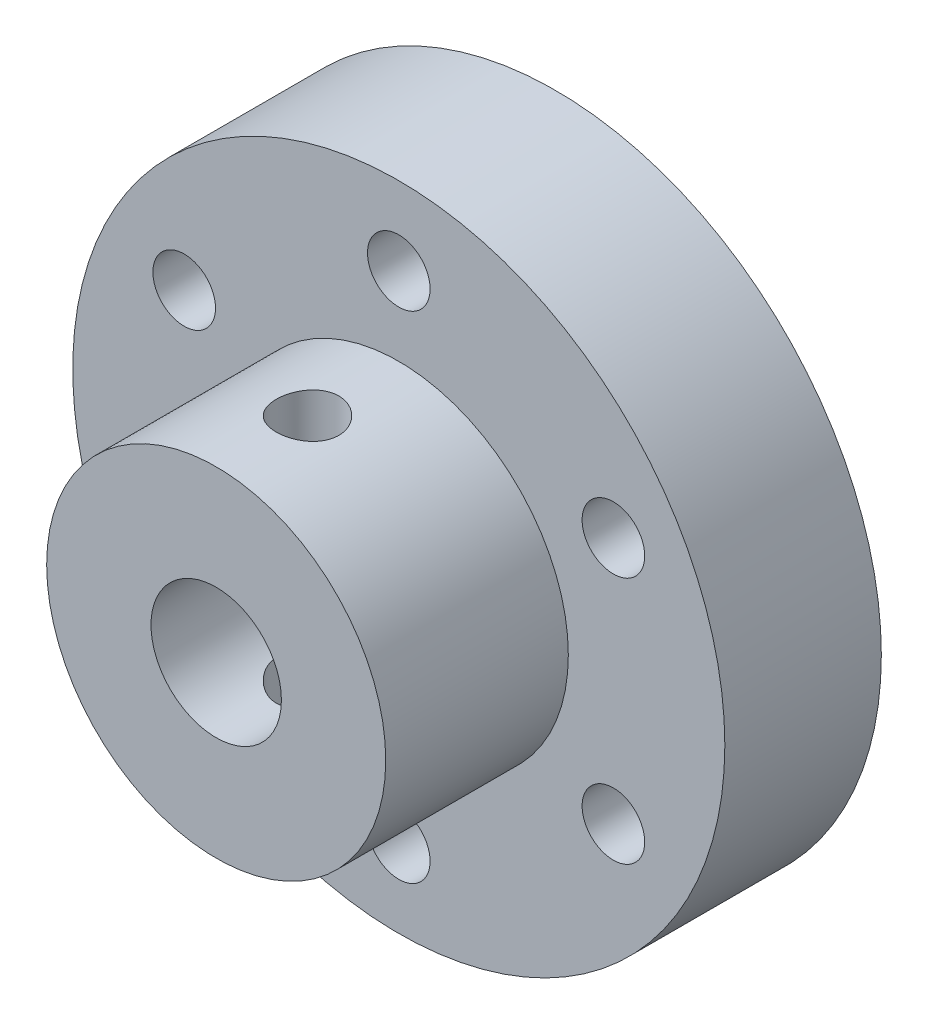
ISO-10303-21;
HEADER;
FILE_DESCRIPTION(('STEP AP214'),'2;1');
FILE_NAME('part.step','',(''),(''),'','','');
FILE_SCHEMA(('AUTOMOTIVE_DESIGN { 1 0 10303 214 1 1 1 1 }'));
ENDSEC;
DATA;
#1=APPLICATION_CONTEXT('core data for automotive mechanical design processes');
#2=APPLICATION_PROTOCOL_DEFINITION('international standard','automotive_design',2000,#1);
#3=PRODUCT_CONTEXT('',#1,'mechanical');
#4=PRODUCT('Part','Part','',(#3));
#5=PRODUCT_RELATED_PRODUCT_CATEGORY('part','',(#4));
#6=PRODUCT_DEFINITION_FORMATION('','',#4);
#7=PRODUCT_DEFINITION_CONTEXT('part definition',#1,'design');
#8=PRODUCT_DEFINITION('design','',#6,#7);
#9=PRODUCT_DEFINITION_SHAPE('','',#8);
#10=(LENGTH_UNIT() NAMED_UNIT(*) SI_UNIT(.MILLI.,.METRE.));
#11=(NAMED_UNIT(*) PLANE_ANGLE_UNIT() SI_UNIT($,.RADIAN.));
#12=(NAMED_UNIT(*) SI_UNIT($,.STERADIAN.) SOLID_ANGLE_UNIT());
#13=UNCERTAINTY_MEASURE_WITH_UNIT(LENGTH_MEASURE(1.E-05),#10,'distance_accuracy_value','');
#14=(GEOMETRIC_REPRESENTATION_CONTEXT(3) GLOBAL_UNCERTAINTY_ASSIGNED_CONTEXT((#13)) GLOBAL_UNIT_ASSIGNED_CONTEXT((#10,
#11,#12)) REPRESENTATION_CONTEXT('',''));
#15=CARTESIAN_POINT('',(0.,0.,0.));
#16=DIRECTION('',(0.,0.,1.));
#17=DIRECTION('',(1.,0.,0.));
#18=AXIS2_PLACEMENT_3D('',#15,#16,#17);
#19=CARTESIAN_POINT('',(0.,0.,13.));
#20=DIRECTION('',(0.,0.,-1.));
#21=DIRECTION('',(-1.,0.,0.));
#22=AXIS2_PLACEMENT_3D('',#19,#20,#21);
#23=CYLINDRICAL_SURFACE('',#22,6.5);
#24=CARTESIAN_POINT('',(0.,0.,13.));
#25=DIRECTION('',(0.,0.,1.));
#26=DIRECTION('',(1.,0.,0.));
#27=AXIS2_PLACEMENT_3D('',#24,#25,#26);
#28=CIRCLE('',#27,6.5);
#29=CARTESIAN_POINT('',(6.5,0.,13.));
#30=VERTEX_POINT('',#29);
#31=EDGE_CURVE('E130',#30,#30,#28,.T.);
#32=ORIENTED_EDGE('',*,*,#31,.F.);
#33=EDGE_LOOP('',(#32));
#34=FACE_BOUND('',#33,.T.);
#35=CARTESIAN_POINT('',(0.,0.,6.));
#36=DIRECTION('',(0.,0.,1.));
#37=DIRECTION('',(1.,0.,0.));
#38=AXIS2_PLACEMENT_3D('',#35,#36,#37);
#39=CIRCLE('',#38,6.5);
#40=CARTESIAN_POINT('',(6.5,0.,6.));
#41=VERTEX_POINT('',#40);
#42=EDGE_CURVE('E132',#41,#41,#39,.T.);
#43=ORIENTED_EDGE('',*,*,#42,.T.);
#44=EDGE_LOOP('',(#43));
#45=FACE_BOUND('',#44,.T.);
#46=CARTESIAN_POINT('',(0.,-6.5,8.3));
#47=CARTESIAN_POINT('',(0.0667962993626081,-6.49999879727572,8.30000257211707));
#48=CARTESIAN_POINT('',(0.133626281673587,-6.49895972178335,8.30559602783191));
#49=CARTESIAN_POINT('',(0.265404300030401,-6.49491478174011,8.32780839939203));
#50=CARTESIAN_POINT('',(0.330350677512255,-6.49190723570874,8.34443674147905));
#51=CARTESIAN_POINT('',(0.456436519782736,-6.48426191804226,8.38819343614064));
#52=CARTESIAN_POINT('',(0.517579319792998,-6.47962559903149,8.41531243477524));
#53=CARTESIAN_POINT('',(0.634441109694969,-6.46922952137734,8.47925437230046));
#54=CARTESIAN_POINT('',(0.690160564109867,-6.46346985907829,8.51607647909212));
#55=CARTESIAN_POINT('',(0.795247744205698,-6.45138834939994,8.59883396557512));
#56=CARTESIAN_POINT('',(0.844543292388614,-6.44506127279023,8.64486024386269));
#57=CARTESIAN_POINT('',(0.934759066401608,-6.43259702053078,8.74452399933484));
#58=CARTESIAN_POINT('',(0.975678701684754,-6.42645985829691,8.79816201273656));
#59=CARTESIAN_POINT('',(1.04827972317034,-6.41501951319584,8.91203468885105));
#60=CARTESIAN_POINT('',(1.07988798202191,-6.40972307507926,8.97231671204541));
#61=CARTESIAN_POINT('',(1.13250094978906,-6.40063738902812,9.09744933105612));
#62=CARTESIAN_POINT('',(1.15350654396689,-6.39684801526784,9.16229954493911));
#63=CARTESIAN_POINT('',(1.18408687284635,-6.39125806003697,9.29395639645086));
#64=CARTESIAN_POINT('',(1.19378730462821,-6.38943562620813,9.36073289196664));
#65=CARTESIAN_POINT('',(1.20187204389847,-6.38791998048299,9.49498860668542));
#66=CARTESIAN_POINT('',(1.20025733484479,-6.38822658354097,9.56246776430737));
#67=CARTESIAN_POINT('',(1.18585961873334,-6.39091446543458,9.69530461296547));
#68=CARTESIAN_POINT('',(1.17321929073711,-6.39326923845306,9.76067838386238));
#69=CARTESIAN_POINT('',(1.13735373323502,-6.39974652439446,9.88836113800026));
#70=CARTESIAN_POINT('',(1.11412806641468,-6.40386911035101,9.95066999450191));
#71=CARTESIAN_POINT('',(1.05761084900825,-6.41344535336497,10.0708730718194));
#72=CARTESIAN_POINT('',(1.0242614500129,-6.41890662438299,10.1287394617883));
#73=CARTESIAN_POINT('',(0.948484370023446,-6.43053982016241,10.2381087118248));
#74=CARTESIAN_POINT('',(0.906055794920213,-6.43671181488758,10.2896109443674));
#75=CARTESIAN_POINT('',(0.812554310960554,-6.44918666593044,10.3856145088169));
#76=CARTESIAN_POINT('',(0.761359307961523,-6.45549008145401,10.4299969416265));
#77=CARTESIAN_POINT('',(0.652187389345436,-6.46743086297198,10.5095611870548));
#78=CARTESIAN_POINT('',(0.594210409619175,-6.47306822266922,10.5447429126901));
#79=CARTESIAN_POINT('',(0.472998043002823,-6.48305257458405,10.6049236018053));
#80=CARTESIAN_POINT('',(0.409756516582691,-6.48739803241448,10.6299104698962));
#81=CARTESIAN_POINT('',(0.279875838888337,-6.49429705012122,10.6688733856488));
#82=CARTESIAN_POINT('',(0.213237038103507,-6.49685079444502,10.6828505667182));
#83=CARTESIAN_POINT('',(0.0794766430718829,-6.49985338930874,10.6992324791651));
#84=CARTESIAN_POINT('',(0.0123756497053713,-6.50033187707818,10.7018001653558));
#85=CARTESIAN_POINT('',(-0.121296981962713,-6.49921181273706,10.6957269238374));
#86=CARTESIAN_POINT('',(-0.187868645294989,-6.49761335943468,10.6870865293404));
#87=CARTESIAN_POINT('',(-0.318077984755796,-6.49253745576473,10.6589778880872));
#88=CARTESIAN_POINT('',(-0.381734009693139,-6.48907427500552,10.6395918384477));
#89=CARTESIAN_POINT('',(-0.504892375398316,-6.4806556240529,10.5906309426582));
#90=CARTESIAN_POINT('',(-0.564394440600633,-6.47570005497306,10.5610554213297));
#91=CARTESIAN_POINT('',(-0.678253095830679,-6.4647724074758,10.4921926389773));
#92=CARTESIAN_POINT('',(-0.732548265605505,-6.45879008348503,10.4528054836735));
#93=CARTESIAN_POINT('',(-0.833816870545852,-6.44649953986676,10.3655729863892));
#94=CARTESIAN_POINT('',(-0.880789643607566,-6.44019129083715,10.3177268803695));
#95=CARTESIAN_POINT('',(-0.966697085412809,-6.42786191143313,10.2141978916263));
#96=CARTESIAN_POINT('',(-1.00552070246097,-6.42184551244879,10.1584222026507));
#97=CARTESIAN_POINT('',(-1.07324774919417,-6.41087523291019,10.0410450642831));
#98=CARTESIAN_POINT('',(-1.10215154047974,-6.40592131362856,9.97944382735008));
#99=CARTESIAN_POINT('',(-1.14905975241548,-6.39767379439307,9.85245029126976));
#100=CARTESIAN_POINT('',(-1.16711570494917,-6.39437235713613,9.7870775593624));
#101=CARTESIAN_POINT('',(-1.19197513111159,-6.38978543443045,9.65415982283927));
#102=CARTESIAN_POINT('',(-1.19877983115992,-6.38849972926177,9.58661505580006));
#103=CARTESIAN_POINT('',(-1.20090353537778,-6.3881007482456,9.45238244271729));
#104=CARTESIAN_POINT('',(-1.19639765292492,-6.38895435075601,9.38569740246967));
#105=CARTESIAN_POINT('',(-1.17641079397786,-6.39266448585662,9.25405258113934));
#106=CARTESIAN_POINT('',(-1.16092987834811,-6.39552100733921,9.18909279049095));
#107=CARTESIAN_POINT('',(-1.11950532017773,-6.40290136886896,9.06283280373736));
#108=CARTESIAN_POINT('',(-1.09358007946632,-6.40742227523992,9.00152638771167));
#109=CARTESIAN_POINT('',(-1.032021760182,-6.41762418955728,8.88410526232611));
#110=CARTESIAN_POINT('',(-0.996388024820644,-6.42330527598439,8.82799090455786));
#111=CARTESIAN_POINT('',(-0.915813071798076,-6.43529057182139,8.72166848381106));
#112=CARTESIAN_POINT('',(-0.870744203302653,-6.44160263227606,8.67155802803138));
#113=CARTESIAN_POINT('',(-0.772845002820406,-6.45407937835197,8.57955246098663));
#114=CARTESIAN_POINT('',(-0.720012889705215,-6.46024402977463,8.53765924017314));
#115=CARTESIAN_POINT('',(-0.607537484977905,-6.47179409996219,8.46293825948846));
#116=CARTESIAN_POINT('',(-0.547839004017674,-6.47717228318667,8.43019242527087));
#117=CARTESIAN_POINT('',(-0.42370854944922,-6.48647285935735,8.37524717130095));
#118=CARTESIAN_POINT('',(-0.3592811283988,-6.49039663100581,8.35303775798059));
#119=CARTESIAN_POINT('',(-0.245545866371185,-6.49553807584249,8.32435080717887));
#120=CARTESIAN_POINT('',(-0.196906528350574,-6.49720192234607,8.31523471554344));
#121=CARTESIAN_POINT('',(-0.0988509306569767,-6.49943331626516,8.30305843317357));
#122=CARTESIAN_POINT('',(-0.0494346897454305,-6.50000089011371,8.29999809642434));
#123=CARTESIAN_POINT('',(0.,-6.5,8.3));
#124=B_SPLINE_CURVE_WITH_KNOTS('',3,(#46,#47,#48,#49,#50,#51,#52,#53,#54,#55,#56,#57,#58,#59,
#60,#61,#62,#63,#64,#65,#66,#67,#68,#69,#70,#71,#72,#73,#74,#75,#76,#77,#78,#79,#80,#81,#82,#83,
#84,#85,#86,#87,#88,#89,#90,#91,#92,#93,#94,#95,#96,#97,#98,#99,#100,#101,#102,#103,#104,#105,
#106,#107,#108,#109,#110,#111,#112,#113,#114,#115,#116,#117,#118,#119,#120,#121,#122,#123),
.UNSPECIFIED.,.T.,.F.,(4,2,2,2,2,2,2,2,2,2,2,2,2,2,2,2,2,2,2,2,2,2,2,2,2,2,2,2,2,2,2,2,2,2,2,2,
2,2,4),(0.,0.200208125257265,0.400587493204053,0.600788604213541,0.800972552376601,
1.00324088953467,1.20552348279051,1.40935476877731,1.61316903319364,1.81469487992138,
2.01620321120369,2.21514193787252,2.41408888408644,2.61419475105378,2.81432033334393,
3.01750151628567,3.2206846200298,3.42410808829514,3.6275106121083,3.8279985269071,
4.02847690406412,4.22744250539259,4.42642129319003,4.62751523490318,4.8286273493452,
5.03232388047527,5.23601298560803,5.43872666786995,5.64141825228765,5.84099112816951,
6.04056289728494,6.23978456857919,6.43901972074741,6.64114822168658,6.84332316977221,
7.04725467103853,7.25099235904023,7.39916621446434,7.54733649711547),.UNSPECIFIED.);
#125=CARTESIAN_POINT('',(0.,-6.5,8.3));
#126=VERTEX_POINT('',#125);
#127=EDGE_CURVE('E76',#126,#126,#124,.T.);
#128=ORIENTED_EDGE('',*,*,#127,.F.);
#129=EDGE_LOOP('',(#128));
#130=FACE_BOUND('',#129,.T.);
#131=CARTESIAN_POINT('',(0.,6.5,8.3));
#132=CARTESIAN_POINT('',(-0.0667962993626081,6.49999879727572,8.30000257211707));
#133=CARTESIAN_POINT('',(-0.133626281673587,6.49895972178335,8.30559602783191));
#134=CARTESIAN_POINT('',(-0.265404300030401,6.49491478174011,8.32780839939203));
#135=CARTESIAN_POINT('',(-0.330350677512255,6.49190723570874,8.34443674147905));
#136=CARTESIAN_POINT('',(-0.456436519782736,6.48426191804226,8.38819343614064));
#137=CARTESIAN_POINT('',(-0.517579319792998,6.47962559903149,8.41531243477524));
#138=CARTESIAN_POINT('',(-0.634441109694969,6.46922952137734,8.47925437230046));
#139=CARTESIAN_POINT('',(-0.690160564109867,6.46346985907829,8.51607647909212));
#140=CARTESIAN_POINT('',(-0.795247744205698,6.45138834939994,8.59883396557512));
#141=CARTESIAN_POINT('',(-0.844543292388614,6.44506127279023,8.64486024386269));
#142=CARTESIAN_POINT('',(-0.934759066401608,6.43259702053078,8.74452399933484));
#143=CARTESIAN_POINT('',(-0.975678701684754,6.42645985829691,8.79816201273656));
#144=CARTESIAN_POINT('',(-1.04827972317034,6.41501951319584,8.91203468885105));
#145=CARTESIAN_POINT('',(-1.07988798202191,6.40972307507926,8.97231671204541));
#146=CARTESIAN_POINT('',(-1.13250094978906,6.40063738902812,9.09744933105612));
#147=CARTESIAN_POINT('',(-1.15350654396689,6.39684801526784,9.16229954493911));
#148=CARTESIAN_POINT('',(-1.18408687284635,6.39125806003697,9.29395639645086));
#149=CARTESIAN_POINT('',(-1.19378730462821,6.38943562620813,9.36073289196664));
#150=CARTESIAN_POINT('',(-1.20187204389847,6.38791998048299,9.49498860668542));
#151=CARTESIAN_POINT('',(-1.20025733484479,6.38822658354097,9.56246776430737));
#152=CARTESIAN_POINT('',(-1.18585961873334,6.39091446543458,9.69530461296547));
#153=CARTESIAN_POINT('',(-1.17321929073711,6.39326923845306,9.76067838386238));
#154=CARTESIAN_POINT('',(-1.13735373323502,6.39974652439446,9.88836113800026));
#155=CARTESIAN_POINT('',(-1.11412806641468,6.40386911035101,9.95066999450191));
#156=CARTESIAN_POINT('',(-1.05761084900825,6.41344535336497,10.0708730718194));
#157=CARTESIAN_POINT('',(-1.0242614500129,6.41890662438299,10.1287394617883));
#158=CARTESIAN_POINT('',(-0.948484370023446,6.43053982016241,10.2381087118248));
#159=CARTESIAN_POINT('',(-0.906055794920213,6.43671181488758,10.2896109443674));
#160=CARTESIAN_POINT('',(-0.812554310960554,6.44918666593044,10.3856145088169));
#161=CARTESIAN_POINT('',(-0.761359307961523,6.45549008145401,10.4299969416265));
#162=CARTESIAN_POINT('',(-0.652187389345436,6.46743086297198,10.5095611870548));
#163=CARTESIAN_POINT('',(-0.594210409619175,6.47306822266922,10.5447429126901));
#164=CARTESIAN_POINT('',(-0.472998043002823,6.48305257458405,10.6049236018053));
#165=CARTESIAN_POINT('',(-0.409756516582691,6.48739803241448,10.6299104698962));
#166=CARTESIAN_POINT('',(-0.279875838888337,6.49429705012122,10.6688733856488));
#167=CARTESIAN_POINT('',(-0.213237038103507,6.49685079444502,10.6828505667182));
#168=CARTESIAN_POINT('',(-0.0794766430718829,6.49985338930874,10.6992324791651));
#169=CARTESIAN_POINT('',(-0.0123756497053713,6.50033187707818,10.7018001653558));
#170=CARTESIAN_POINT('',(0.121296981962713,6.49921181273706,10.6957269238374));
#171=CARTESIAN_POINT('',(0.187868645294989,6.49761335943468,10.6870865293404));
#172=CARTESIAN_POINT('',(0.318077984755796,6.49253745576473,10.6589778880872));
#173=CARTESIAN_POINT('',(0.381734009693139,6.48907427500552,10.6395918384477));
#174=CARTESIAN_POINT('',(0.504892375398316,6.4806556240529,10.5906309426582));
#175=CARTESIAN_POINT('',(0.564394440600633,6.47570005497306,10.5610554213297));
#176=CARTESIAN_POINT('',(0.678253095830679,6.4647724074758,10.4921926389773));
#177=CARTESIAN_POINT('',(0.732548265605505,6.45879008348503,10.4528054836735));
#178=CARTESIAN_POINT('',(0.833816870545852,6.44649953986676,10.3655729863892));
#179=CARTESIAN_POINT('',(0.880789643607566,6.44019129083715,10.3177268803695));
#180=CARTESIAN_POINT('',(0.966697085412809,6.42786191143313,10.2141978916263));
#181=CARTESIAN_POINT('',(1.00552070246097,6.42184551244879,10.1584222026507));
#182=CARTESIAN_POINT('',(1.07324774919417,6.41087523291019,10.0410450642831));
#183=CARTESIAN_POINT('',(1.10215154047974,6.40592131362856,9.97944382735008));
#184=CARTESIAN_POINT('',(1.14905975241548,6.39767379439307,9.85245029126976));
#185=CARTESIAN_POINT('',(1.16711570494917,6.39437235713613,9.7870775593624));
#186=CARTESIAN_POINT('',(1.19197513111159,6.38978543443045,9.65415982283927));
#187=CARTESIAN_POINT('',(1.19877983115992,6.38849972926177,9.58661505580006));
#188=CARTESIAN_POINT('',(1.20090353537778,6.3881007482456,9.45238244271729));
#189=CARTESIAN_POINT('',(1.19639765292492,6.38895435075601,9.38569740246967));
#190=CARTESIAN_POINT('',(1.17641079397786,6.39266448585662,9.25405258113934));
#191=CARTESIAN_POINT('',(1.16092987834811,6.39552100733921,9.18909279049095));
#192=CARTESIAN_POINT('',(1.11950532017773,6.40290136886896,9.06283280373736));
#193=CARTESIAN_POINT('',(1.09358007946632,6.40742227523992,9.00152638771167));
#194=CARTESIAN_POINT('',(1.032021760182,6.41762418955728,8.88410526232611));
#195=CARTESIAN_POINT('',(0.996388024820644,6.42330527598439,8.82799090455786));
#196=CARTESIAN_POINT('',(0.915813071798076,6.43529057182139,8.72166848381106));
#197=CARTESIAN_POINT('',(0.870744203302653,6.44160263227606,8.67155802803138));
#198=CARTESIAN_POINT('',(0.772845002820406,6.45407937835197,8.57955246098663));
#199=CARTESIAN_POINT('',(0.720012889705215,6.46024402977463,8.53765924017314));
#200=CARTESIAN_POINT('',(0.607537484977905,6.47179409996219,8.46293825948846));
#201=CARTESIAN_POINT('',(0.547839004017674,6.47717228318667,8.43019242527087));
#202=CARTESIAN_POINT('',(0.42370854944922,6.48647285935735,8.37524717130095));
#203=CARTESIAN_POINT('',(0.3592811283988,6.49039663100581,8.35303775798059));
#204=CARTESIAN_POINT('',(0.245545866371185,6.49553807584249,8.32435080717887));
#205=CARTESIAN_POINT('',(0.196906528350574,6.49720192234607,8.31523471554344));
#206=CARTESIAN_POINT('',(0.0988509306569767,6.49943331626516,8.30305843317357));
#207=CARTESIAN_POINT('',(0.0494346897454305,6.50000089011371,8.29999809642434));
#208=CARTESIAN_POINT('',(0.,6.5,8.3));
#209=B_SPLINE_CURVE_WITH_KNOTS('',3,(#131,#132,#133,#134,#135,#136,#137,#138,#139,#140,#141,
#142,#143,#144,#145,#146,#147,#148,#149,#150,#151,#152,#153,#154,#155,#156,#157,#158,#159,#160,
#161,#162,#163,#164,#165,#166,#167,#168,#169,#170,#171,#172,#173,#174,#175,#176,#177,#178,#179,
#180,#181,#182,#183,#184,#185,#186,#187,#188,#189,#190,#191,#192,#193,#194,#195,#196,#197,#198,
#199,#200,#201,#202,#203,#204,#205,#206,#207,#208),.UNSPECIFIED.,.T.,.F.,(4,2,2,2,2,2,2,2,2,2,2,
2,2,2,2,2,2,2,2,2,2,2,2,2,2,2,2,2,2,2,2,2,2,2,2,2,2,2,4),(0.,0.200208125257265,
0.400587493204053,0.600788604213541,0.800972552376601,1.00324088953467,1.20552348279051,
1.40935476877731,1.61316903319364,1.81469487992138,2.01620321120369,2.21514193787252,
2.41408888408644,2.61419475105378,2.81432033334393,3.01750151628567,3.2206846200298,
3.42410808829514,3.6275106121083,3.8279985269071,4.02847690406412,4.22744250539259,
4.42642129319003,4.62751523490318,4.8286273493452,5.03232388047527,5.23601298560803,
5.43872666786995,5.64141825228765,5.84099112816951,6.04056289728494,6.23978456857919,
6.43901972074741,6.64114822168658,6.84332316977221,7.04725467103853,7.25099235904023,
7.39916621446434,7.54733649711547),.UNSPECIFIED.);
#210=CARTESIAN_POINT('',(0.,6.5,8.3));
#211=VERTEX_POINT('',#210);
#212=EDGE_CURVE('E82',#211,#211,#209,.T.);
#213=ORIENTED_EDGE('',*,*,#212,.F.);
#214=EDGE_LOOP('',(#213));
#215=FACE_BOUND('',#214,.T.);
#216=ADVANCED_FACE('F31',(#34,#45,#130,#215),#23,.T.);
#217=CARTESIAN_POINT('',(0.,0.,13.));
#218=DIRECTION('',(0.,0.,-1.));
#219=DIRECTION('',(-1.,0.,0.));
#220=AXIS2_PLACEMENT_3D('',#217,#218,#219);
#221=CYLINDRICAL_SURFACE('',#220,2.5);
#222=CARTESIAN_POINT('',(0.,-2.5,8.3));
#223=CARTESIAN_POINT('',(0.0633849742179673,-2.49999684385891,8.30000370648809));
#224=CARTESIAN_POINT('',(0.126854370812595,-2.49756312112456,8.30505164362475));
#225=CARTESIAN_POINT('',(0.251936101998812,-2.48806801727453,8.325028983493));
#226=CARTESIAN_POINT('',(0.313544265904984,-2.48099694847778,8.33997907303935));
#227=CARTESIAN_POINT('',(0.432899849747275,-2.46297121786789,8.37905156229005));
#228=CARTESIAN_POINT('',(0.490660900321686,-2.45203124122226,8.40313930310366));
#229=CARTESIAN_POINT('',(0.60124535759609,-2.42728640809076,8.45963335220408));
#230=CARTESIAN_POINT('',(0.654069413581729,-2.4134819290992,8.4920385645181));
#231=CARTESIAN_POINT('',(0.756672008759831,-2.38337302664708,8.56635874632256));
#232=CARTESIAN_POINT('',(0.806104935594568,-2.36697091704208,8.60871073907671));
#233=CARTESIAN_POINT('',(0.897480036845475,-2.3338586106312,8.70078689566182));
#234=CARTESIAN_POINT('',(0.939416979471579,-2.31714820755791,8.75051616447448));
#235=CARTESIAN_POINT('',(1.01754320621259,-2.28397287809421,8.86012166281187));
#236=CARTESIAN_POINT('',(1.05312476430902,-2.26760699355557,8.92046447845293));
#237=CARTESIAN_POINT('',(1.11348408792889,-2.23858941478561,9.04715667046847));
#238=CARTESIAN_POINT('',(1.13826909234645,-2.22593523378932,9.1135019861197));
#239=CARTESIAN_POINT('',(1.17479858114972,-2.20686509491432,9.24639257733738));
#240=CARTESIAN_POINT('',(1.18721180020386,-2.20013187804712,9.31270634717295));
#241=CARTESIAN_POINT('',(1.20070733624948,-2.19279905539547,9.44678957240425));
#242=CARTESIAN_POINT('',(1.20179935761816,-2.19219419647575,9.51455773116942));
#243=CARTESIAN_POINT('',(1.19311469398861,-2.19692748260396,9.64176853081165));
#244=CARTESIAN_POINT('',(1.18449959005718,-2.20163056600635,9.70131958394927));
#245=CARTESIAN_POINT('',(1.15864142470197,-2.21534692921024,9.81799745385986));
#246=CARTESIAN_POINT('',(1.14139595212355,-2.22436141350086,9.87512358831726));
#247=CARTESIAN_POINT('',(1.09843555987642,-2.24589080547588,9.98694185262371));
#248=CARTESIAN_POINT('',(1.07253294877242,-2.25848226491406,10.0415464458527));
#249=CARTESIAN_POINT('',(1.01313344094007,-2.28574437002242,10.1458859580842));
#250=CARTESIAN_POINT('',(0.979633174271466,-2.30041593723866,10.1956187021187));
#251=CARTESIAN_POINT('',(0.901464111982097,-2.33223919109194,10.2948578772651));
#252=CARTESIAN_POINT('',(0.85595175893152,-2.34948147766575,10.3436730304729));
#253=CARTESIAN_POINT('',(0.75728622082949,-2.38311434513901,10.433252185107));
#254=CARTESIAN_POINT('',(0.704129930767406,-2.39950457622712,10.4740128987222));
#255=CARTESIAN_POINT('',(0.588992124092923,-2.43038572230261,10.5478283711417));
#256=CARTESIAN_POINT('',(0.526744081421431,-2.44477544111425,10.5805130948424));
#257=CARTESIAN_POINT('',(0.396765720474065,-2.46919745924495,10.6346911077138));
#258=CARTESIAN_POINT('',(0.329039471001532,-2.47923295793025,10.6561926163331));
#259=CARTESIAN_POINT('',(0.195718131600795,-2.49315669713845,10.6857425282756));
#260=CARTESIAN_POINT('',(0.130371482184072,-2.49746478900867,10.6947125912192));
#261=CARTESIAN_POINT('',(-0.00103238515457059,-2.50086207141464,10.7017997500693));
#262=CARTESIAN_POINT('',(-0.0670892927363438,-2.4999534556786,10.6999214079415));
#263=CARTESIAN_POINT('',(-0.193123316285083,-2.4932728768651,10.6859348130393));
#264=CARTESIAN_POINT('',(-0.253201883269907,-2.4878465157843,10.6745533621869));
#265=CARTESIAN_POINT('',(-0.370489514239621,-2.47310188561777,10.6429903895089));
#266=CARTESIAN_POINT('',(-0.427698249411483,-2.46378317169856,10.6228078618498));
#267=CARTESIAN_POINT('',(-0.539593801410593,-2.44175951914454,10.5736323177078));
#268=CARTESIAN_POINT('',(-0.594153429738361,-2.42896136015527,10.5443930958483));
#269=CARTESIAN_POINT('',(-0.697781190567038,-2.40124618620779,10.4782054654661));
#270=CARTESIAN_POINT('',(-0.746846909587697,-2.38632824650655,10.4412536890665));
#271=CARTESIAN_POINT('',(-0.842873798160822,-2.35422107284488,10.356750671008));
#272=CARTESIAN_POINT('',(-0.889225495967946,-2.33694916915075,10.3085368470266));
#273=CARTESIAN_POINT('',(-0.97343008777859,-2.30314934154574,10.2049076280905));
#274=CARTESIAN_POINT('',(-1.01127822755546,-2.28662183792686,10.1494882317929));
#275=CARTESIAN_POINT('',(-1.07873607730324,-2.2556069584878,10.0302772602201));
#276=CARTESIAN_POINT('',(-1.10797295572395,-2.24122249229772,9.9662456666059));
#277=CARTESIAN_POINT('',(-1.15494631784804,-2.21738674528501,9.83325192023934));
#278=CARTESIAN_POINT('',(-1.17269639468182,-2.20792963617194,9.76429570287884));
#279=CARTESIAN_POINT('',(-1.19465474613,-2.19611962570153,9.63028263211508));
#280=CARTESIAN_POINT('',(-1.19996744321152,-2.19318858167521,9.56545828249615));
#281=CARTESIAN_POINT('',(-1.2000322208,-2.19315404190355,9.43581269383091));
#282=CARTESIAN_POINT('',(-1.19478781986411,-2.19604860455165,9.37099146094644));
#283=CARTESIAN_POINT('',(-1.1748980429029,-2.20674497123885,9.2487253246722));
#284=CARTESIAN_POINT('',(-1.16105236546225,-2.21412829866181,9.19110940118316));
#285=CARTESIAN_POINT('',(-1.1252866074732,-2.23251696488275,9.07905904144424));
#286=CARTESIAN_POINT('',(-1.10336406140807,-2.24352340955145,9.02462558254745));
#287=CARTESIAN_POINT('',(-1.05040716590157,-2.26882328290811,8.91646699976793));
#288=CARTESIAN_POINT('',(-1.01886080058498,-2.28328751262241,8.86303360235449));
#289=CARTESIAN_POINT('',(-0.948152153973279,-2.31354400874608,8.76188093120729));
#290=CARTESIAN_POINT('',(-0.908986128039517,-2.32933692595659,8.71416448574386));
#291=CARTESIAN_POINT('',(-0.819149694061577,-2.36252519611289,8.62042538069649));
#292=CARTESIAN_POINT('',(-0.767691958629031,-2.3799083892852,8.57514892576238));
#293=CARTESIAN_POINT('',(-0.657371196902567,-2.41271041519055,8.49373870031008));
#294=CARTESIAN_POINT('',(-0.598504520879331,-2.42812827218994,8.45760946241547));
#295=CARTESIAN_POINT('',(-0.474804107606464,-2.45531401707798,8.39576327805479));
#296=CARTESIAN_POINT('',(-0.409975812829995,-2.46708519202428,8.37003694815901));
#297=CARTESIAN_POINT('',(-0.276277415550764,-2.48559657511608,8.33016813803939));
#298=CARTESIAN_POINT('',(-0.207419779549854,-2.49235149862408,8.31599176360715));
#299=CARTESIAN_POINT('',(-0.114956061483877,-2.49746191467227,8.30529572720423));
#300=CARTESIAN_POINT('',(-0.0920238242785925,-2.49841158308983,8.30331222135545));
#301=CARTESIAN_POINT('',(-0.0460647770818748,-2.49968120698223,8.30066366813027));
#302=CARTESIAN_POINT('',(-0.0230379648028422,-2.50000114713413,8.29999865283621));
#303=CARTESIAN_POINT('',(0.,-2.5,8.3));
#304=B_SPLINE_CURVE_WITH_KNOTS('',3,(#222,#223,#224,#225,#226,#227,#228,#229,#230,#231,#232,
#233,#234,#235,#236,#237,#238,#239,#240,#241,#242,#243,#244,#245,#246,#247,#248,#249,#250,#251,
#252,#253,#254,#255,#256,#257,#258,#259,#260,#261,#262,#263,#264,#265,#266,#267,#268,#269,#270,
#271,#272,#273,#274,#275,#276,#277,#278,#279,#280,#281,#282,#283,#284,#285,#286,#287,#288,#289,
#290,#291,#292,#293,#294,#295,#296,#297,#298,#299,#300,#301,#302,#303),.UNSPECIFIED.,.T.,.F.,(4,
2,2,2,2,2,2,2,2,2,2,2,2,2,2,2,2,2,2,2,2,2,2,2,2,2,2,2,2,2,2,2,2,2,2,2,2,2,2,2,4),(0.,
0.190061051260785,0.380520421131581,0.57026449156264,0.759983572707097,0.960524852603022,
1.16120555749543,1.37593216553996,1.59051458084295,1.7927406006974,1.99479326080114,
2.1750147680024,2.35528665366777,2.53975218942436,2.72429970544775,2.9301890909405,
3.13616234736342,3.35031022232777,3.56430047950079,3.76153307471438,3.95868273581696,
4.14200365721815,4.3253455349944,4.51418899570865,4.70311509274789,4.90943190815755,
5.11586378710751,5.33023499254597,5.54435205150114,5.73858642474551,5.93275607266577,
6.11112580194469,6.28955002491833,6.47992680285666,6.67039737779789,6.88154505737434,
7.09279716084658,7.30385828744261,7.51429778555126,7.58337588054014,7.65245565636019),.UNSPECIFIED.);
#305=CARTESIAN_POINT('',(0.,-2.5,8.3));
#306=VERTEX_POINT('',#305);
#307=EDGE_CURVE('E48',#306,#306,#304,.T.);
#308=ORIENTED_EDGE('',*,*,#307,.T.);
#309=EDGE_LOOP('',(#308));
#310=FACE_BOUND('',#309,.T.);
#311=CARTESIAN_POINT('',(0.,0.,13.));
#312=DIRECTION('',(0.,0.,1.));
#313=DIRECTION('',(1.,0.,0.));
#314=AXIS2_PLACEMENT_3D('',#311,#312,#313);
#315=CIRCLE('',#314,2.5);
#316=CARTESIAN_POINT('',(2.5,0.,13.));
#317=VERTEX_POINT('',#316);
#318=EDGE_CURVE('E136',#317,#317,#315,.T.);
#319=ORIENTED_EDGE('',*,*,#318,.T.);
#320=EDGE_LOOP('',(#319));
#321=FACE_BOUND('',#320,.T.);
#322=CARTESIAN_POINT('',(0.,0.,6.));
#323=DIRECTION('',(0.,0.,1.));
#324=DIRECTION('',(1.,0.,0.));
#325=AXIS2_PLACEMENT_3D('',#322,#323,#324);
#326=CIRCLE('',#325,2.5);
#327=CARTESIAN_POINT('',(2.5,0.,6.));
#328=VERTEX_POINT('',#327);
#329=EDGE_CURVE('E10',#328,#328,#326,.F.);
#330=ORIENTED_EDGE('',*,*,#329,.T.);
#331=EDGE_LOOP('',(#330));
#332=FACE_BOUND('',#331,.T.);
#333=CARTESIAN_POINT('',(0.,2.5,8.3));
#334=CARTESIAN_POINT('',(-0.0633849742179673,2.49999684385891,8.30000370648809));
#335=CARTESIAN_POINT('',(-0.126854370812595,2.49756312112456,8.30505164362475));
#336=CARTESIAN_POINT('',(-0.251936101998812,2.48806801727453,8.325028983493));
#337=CARTESIAN_POINT('',(-0.313544265904984,2.48099694847778,8.33997907303935));
#338=CARTESIAN_POINT('',(-0.432899849747275,2.46297121786789,8.37905156229005));
#339=CARTESIAN_POINT('',(-0.490660900321686,2.45203124122226,8.40313930310366));
#340=CARTESIAN_POINT('',(-0.60124535759609,2.42728640809076,8.45963335220408));
#341=CARTESIAN_POINT('',(-0.654069413581729,2.4134819290992,8.4920385645181));
#342=CARTESIAN_POINT('',(-0.756672008759831,2.38337302664708,8.56635874632256));
#343=CARTESIAN_POINT('',(-0.806104935594568,2.36697091704208,8.60871073907671));
#344=CARTESIAN_POINT('',(-0.897480036845475,2.3338586106312,8.70078689566182));
#345=CARTESIAN_POINT('',(-0.939416979471579,2.31714820755791,8.75051616447448));
#346=CARTESIAN_POINT('',(-1.01754320621259,2.28397287809421,8.86012166281187));
#347=CARTESIAN_POINT('',(-1.05312476430902,2.26760699355557,8.92046447845293));
#348=CARTESIAN_POINT('',(-1.11348408792889,2.23858941478561,9.04715667046847));
#349=CARTESIAN_POINT('',(-1.13826909234645,2.22593523378932,9.1135019861197));
#350=CARTESIAN_POINT('',(-1.17479858114972,2.20686509491432,9.24639257733738));
#351=CARTESIAN_POINT('',(-1.18721180020386,2.20013187804712,9.31270634717295));
#352=CARTESIAN_POINT('',(-1.20070733624948,2.19279905539547,9.44678957240425));
#353=CARTESIAN_POINT('',(-1.20179935761816,2.19219419647575,9.51455773116942));
#354=CARTESIAN_POINT('',(-1.19311469398861,2.19692748260396,9.64176853081165));
#355=CARTESIAN_POINT('',(-1.18449959005718,2.20163056600635,9.70131958394927));
#356=CARTESIAN_POINT('',(-1.15864142470197,2.21534692921024,9.81799745385986));
#357=CARTESIAN_POINT('',(-1.14139595212355,2.22436141350086,9.87512358831726));
#358=CARTESIAN_POINT('',(-1.09843555987642,2.24589080547588,9.98694185262371));
#359=CARTESIAN_POINT('',(-1.07253294877242,2.25848226491406,10.0415464458527));
#360=CARTESIAN_POINT('',(-1.01313344094007,2.28574437002242,10.1458859580842));
#361=CARTESIAN_POINT('',(-0.979633174271466,2.30041593723866,10.1956187021187));
#362=CARTESIAN_POINT('',(-0.901464111982097,2.33223919109194,10.2948578772651));
#363=CARTESIAN_POINT('',(-0.85595175893152,2.34948147766575,10.3436730304729));
#364=CARTESIAN_POINT('',(-0.75728622082949,2.38311434513901,10.433252185107));
#365=CARTESIAN_POINT('',(-0.704129930767406,2.39950457622712,10.4740128987222));
#366=CARTESIAN_POINT('',(-0.588992124092923,2.43038572230261,10.5478283711417));
#367=CARTESIAN_POINT('',(-0.526744081421431,2.44477544111425,10.5805130948424));
#368=CARTESIAN_POINT('',(-0.396765720474065,2.46919745924495,10.6346911077138));
#369=CARTESIAN_POINT('',(-0.329039471001532,2.47923295793025,10.6561926163331));
#370=CARTESIAN_POINT('',(-0.195718131600795,2.49315669713845,10.6857425282756));
#371=CARTESIAN_POINT('',(-0.130371482184072,2.49746478900867,10.6947125912192));
#372=CARTESIAN_POINT('',(0.00103238515457059,2.50086207141464,10.7017997500693));
#373=CARTESIAN_POINT('',(0.0670892927363438,2.4999534556786,10.6999214079415));
#374=CARTESIAN_POINT('',(0.193123316285083,2.4932728768651,10.6859348130393));
#375=CARTESIAN_POINT('',(0.253201883269907,2.4878465157843,10.6745533621869));
#376=CARTESIAN_POINT('',(0.370489514239621,2.47310188561777,10.6429903895089));
#377=CARTESIAN_POINT('',(0.427698249411483,2.46378317169856,10.6228078618498));
#378=CARTESIAN_POINT('',(0.539593801410593,2.44175951914454,10.5736323177078));
#379=CARTESIAN_POINT('',(0.594153429738361,2.42896136015527,10.5443930958483));
#380=CARTESIAN_POINT('',(0.697781190567038,2.40124618620779,10.4782054654661));
#381=CARTESIAN_POINT('',(0.746846909587697,2.38632824650655,10.4412536890665));
#382=CARTESIAN_POINT('',(0.842873798160822,2.35422107284488,10.356750671008));
#383=CARTESIAN_POINT('',(0.889225495967946,2.33694916915075,10.3085368470266));
#384=CARTESIAN_POINT('',(0.97343008777859,2.30314934154574,10.2049076280905));
#385=CARTESIAN_POINT('',(1.01127822755546,2.28662183792686,10.1494882317929));
#386=CARTESIAN_POINT('',(1.07873607730324,2.2556069584878,10.0302772602201));
#387=CARTESIAN_POINT('',(1.10797295572395,2.24122249229772,9.9662456666059));
#388=CARTESIAN_POINT('',(1.15494631784804,2.21738674528501,9.83325192023934));
#389=CARTESIAN_POINT('',(1.17269639468182,2.20792963617194,9.76429570287884));
#390=CARTESIAN_POINT('',(1.19465474613,2.19611962570153,9.63028263211508));
#391=CARTESIAN_POINT('',(1.19996744321152,2.19318858167521,9.56545828249615));
#392=CARTESIAN_POINT('',(1.2000322208,2.19315404190355,9.43581269383091));
#393=CARTESIAN_POINT('',(1.19478781986411,2.19604860455165,9.37099146094644));
#394=CARTESIAN_POINT('',(1.1748980429029,2.20674497123885,9.2487253246722));
#395=CARTESIAN_POINT('',(1.16105236546225,2.21412829866181,9.19110940118316));
#396=CARTESIAN_POINT('',(1.1252866074732,2.23251696488275,9.07905904144424));
#397=CARTESIAN_POINT('',(1.10336406140807,2.24352340955145,9.02462558254745));
#398=CARTESIAN_POINT('',(1.05040716590157,2.26882328290811,8.91646699976793));
#399=CARTESIAN_POINT('',(1.01886080058498,2.28328751262241,8.86303360235449));
#400=CARTESIAN_POINT('',(0.948152153973279,2.31354400874608,8.76188093120729));
#401=CARTESIAN_POINT('',(0.908986128039517,2.32933692595659,8.71416448574386));
#402=CARTESIAN_POINT('',(0.819149694061577,2.36252519611289,8.62042538069649));
#403=CARTESIAN_POINT('',(0.767691958629031,2.3799083892852,8.57514892576238));
#404=CARTESIAN_POINT('',(0.657371196902567,2.41271041519055,8.49373870031008));
#405=CARTESIAN_POINT('',(0.598504520879331,2.42812827218994,8.45760946241547));
#406=CARTESIAN_POINT('',(0.474804107606464,2.45531401707798,8.39576327805479));
#407=CARTESIAN_POINT('',(0.409975812829995,2.46708519202428,8.37003694815901));
#408=CARTESIAN_POINT('',(0.276277415550764,2.48559657511608,8.33016813803939));
#409=CARTESIAN_POINT('',(0.207419779549854,2.49235149862408,8.31599176360715));
#410=CARTESIAN_POINT('',(0.114956061483877,2.49746191467227,8.30529572720423));
#411=CARTESIAN_POINT('',(0.0920238242785925,2.49841158308983,8.30331222135545));
#412=CARTESIAN_POINT('',(0.0460647770818748,2.49968120698223,8.30066366813027));
#413=CARTESIAN_POINT('',(0.0230379648028422,2.50000114713413,8.29999865283621));
#414=CARTESIAN_POINT('',(0.,2.5,8.3));
#415=B_SPLINE_CURVE_WITH_KNOTS('',3,(#333,#334,#335,#336,#337,#338,#339,#340,#341,#342,#343,
#344,#345,#346,#347,#348,#349,#350,#351,#352,#353,#354,#355,#356,#357,#358,#359,#360,#361,#362,
#363,#364,#365,#366,#367,#368,#369,#370,#371,#372,#373,#374,#375,#376,#377,#378,#379,#380,#381,
#382,#383,#384,#385,#386,#387,#388,#389,#390,#391,#392,#393,#394,#395,#396,#397,#398,#399,#400,
#401,#402,#403,#404,#405,#406,#407,#408,#409,#410,#411,#412,#413,#414),.UNSPECIFIED.,.T.,.F.,(4,
2,2,2,2,2,2,2,2,2,2,2,2,2,2,2,2,2,2,2,2,2,2,2,2,2,2,2,2,2,2,2,2,2,2,2,2,2,2,2,4),(0.,
0.190061051260785,0.380520421131581,0.57026449156264,0.759983572707097,0.960524852603022,
1.16120555749543,1.37593216553996,1.59051458084295,1.7927406006974,1.99479326080114,
2.1750147680024,2.35528665366777,2.53975218942436,2.72429970544775,2.9301890909405,
3.13616234736342,3.35031022232777,3.56430047950079,3.76153307471438,3.95868273581696,
4.14200365721815,4.3253455349944,4.51418899570865,4.70311509274789,4.90943190815755,
5.11586378710751,5.33023499254597,5.54435205150114,5.73858642474551,5.93275607266577,
6.11112580194469,6.28955002491833,6.47992680285666,6.67039737779789,6.88154505737434,
7.09279716084658,7.30385828744261,7.51429778555126,7.58337588054014,7.65245565636019),.UNSPECIFIED.);
#416=CARTESIAN_POINT('',(0.,2.5,8.3));
#417=VERTEX_POINT('',#416);
#418=EDGE_CURVE('E55',#417,#417,#415,.T.);
#419=ORIENTED_EDGE('',*,*,#418,.T.);
#420=EDGE_LOOP('',(#419));
#421=FACE_BOUND('',#420,.T.);
#422=ADVANCED_FACE('F60',(#310,#321,#332,#421),#221,.F.);
#423=CARTESIAN_POINT('',(0.,0.,6.));
#424=DIRECTION('',(0.,0.,-1.));
#425=DIRECTION('',(-1.,0.,0.));
#426=AXIS2_PLACEMENT_3D('',#423,#424,#425);
#427=CYLINDRICAL_SURFACE('',#426,12.5);
#428=CARTESIAN_POINT('',(0.,0.,6.));
#429=DIRECTION('',(0.,0.,1.));
#430=DIRECTION('',(1.,0.,0.));
#431=AXIS2_PLACEMENT_3D('',#428,#429,#430);
#432=CIRCLE('',#431,12.5);
#433=CARTESIAN_POINT('',(12.5,0.,6.));
#434=VERTEX_POINT('',#433);
#435=EDGE_CURVE('E39',#434,#434,#432,.T.);
#436=ORIENTED_EDGE('',*,*,#435,.F.);
#437=EDGE_LOOP('',(#436));
#438=FACE_BOUND('',#437,.T.);
#439=CARTESIAN_POINT('',(0.,0.,0.));
#440=DIRECTION('',(0.,0.,1.));
#441=DIRECTION('',(1.,0.,0.));
#442=AXIS2_PLACEMENT_3D('',#439,#440,#441);
#443=CIRCLE('',#442,12.5);
#444=CARTESIAN_POINT('',(12.5,0.,0.));
#445=VERTEX_POINT('',#444);
#446=EDGE_CURVE('E44',#445,#445,#443,.T.);
#447=ORIENTED_EDGE('',*,*,#446,.T.);
#448=EDGE_LOOP('',(#447));
#449=FACE_BOUND('',#448,.T.);
#450=ADVANCED_FACE('F33',(#438,#449),#427,.T.);
#451=CARTESIAN_POINT('',(0.,0.,6.));
#452=DIRECTION('',(0.,0.,1.));
#453=DIRECTION('',(1.,0.,0.));
#454=AXIS2_PLACEMENT_3D('',#451,#452,#453);
#455=PLANE('',#454);
#456=CARTESIAN_POINT('',(8.22724133595211,4.7500000000001,6.));
#457=DIRECTION('',(0.,0.,1.));
#458=DIRECTION('',(1.,0.,0.));
#459=AXIS2_PLACEMENT_3D('',#456,#457,#458);
#460=CIRCLE('',#459,1.2);
#461=CARTESIAN_POINT('',(9.42724133595211,4.7500000000001,6.));
#462=VERTEX_POINT('',#461);
#463=EDGE_CURVE('E250',#462,#462,#460,.F.);
#464=ORIENTED_EDGE('',*,*,#463,.T.);
#465=EDGE_LOOP('',(#464));
#466=FACE_BOUND('',#465,.T.);
#467=CARTESIAN_POINT('',(8.22724133595221,-4.74999999999992,6.));
#468=DIRECTION('',(0.,0.,1.));
#469=DIRECTION('',(1.,0.,0.));
#470=AXIS2_PLACEMENT_3D('',#467,#468,#469);
#471=CIRCLE('',#470,1.2);
#472=CARTESIAN_POINT('',(9.42724133595221,-4.74999999999992,6.));
#473=VERTEX_POINT('',#472);
#474=EDGE_CURVE('E252',#473,#473,#471,.F.);
#475=ORIENTED_EDGE('',*,*,#474,.T.);
#476=EDGE_LOOP('',(#475));
#477=FACE_BOUND('',#476,.T.);
#478=CARTESIAN_POINT('',(0.,-9.5,6.));
#479=DIRECTION('',(0.,0.,1.));
#480=DIRECTION('',(1.,0.,0.));
#481=AXIS2_PLACEMENT_3D('',#478,#479,#480);
#482=CIRCLE('',#481,1.2);
#483=CARTESIAN_POINT('',(1.2,-9.5,6.));
#484=VERTEX_POINT('',#483);
#485=EDGE_CURVE('E256',#484,#484,#482,.F.);
#486=ORIENTED_EDGE('',*,*,#485,.T.);
#487=EDGE_LOOP('',(#486));
#488=FACE_BOUND('',#487,.T.);
#489=CARTESIAN_POINT('',(-8.22724133595215,-4.75000000000004,6.));
#490=DIRECTION('',(0.,0.,1.));
#491=DIRECTION('',(1.,0.,0.));
#492=AXIS2_PLACEMENT_3D('',#489,#490,#491);
#493=CIRCLE('',#492,1.2);
#494=CARTESIAN_POINT('',(-7.02724133595215,-4.75000000000004,6.));
#495=VERTEX_POINT('',#494);
#496=EDGE_CURVE('E259',#495,#495,#493,.F.);
#497=ORIENTED_EDGE('',*,*,#496,.T.);
#498=EDGE_LOOP('',(#497));
#499=FACE_BOUND('',#498,.T.);
#500=CARTESIAN_POINT('',(-8.22724133595218,4.74999999999998,6.));
#501=DIRECTION('',(0.,0.,1.));
#502=DIRECTION('',(1.,0.,0.));
#503=AXIS2_PLACEMENT_3D('',#500,#501,#502);
#504=CIRCLE('',#503,1.2);
#505=CARTESIAN_POINT('',(-7.02724133595218,4.74999999999998,6.));
#506=VERTEX_POINT('',#505);
#507=EDGE_CURVE('E261',#506,#506,#504,.F.);
#508=ORIENTED_EDGE('',*,*,#507,.T.);
#509=EDGE_LOOP('',(#508));
#510=FACE_BOUND('',#509,.T.);
#511=CARTESIAN_POINT('',(0.,9.5,6.));
#512=DIRECTION('',(0.,0.,1.));
#513=DIRECTION('',(1.,0.,0.));
#514=AXIS2_PLACEMENT_3D('',#511,#512,#513);
#515=CIRCLE('',#514,1.2);
#516=CARTESIAN_POINT('',(1.2,9.5,6.));
#517=VERTEX_POINT('',#516);
#518=EDGE_CURVE('E56',#517,#517,#515,.F.);
#519=ORIENTED_EDGE('',*,*,#518,.T.);
#520=EDGE_LOOP('',(#519));
#521=FACE_BOUND('',#520,.T.);
#522=ORIENTED_EDGE('',*,*,#42,.F.);
#523=EDGE_LOOP('',(#522));
#524=FACE_BOUND('',#523,.T.);
#525=ORIENTED_EDGE('',*,*,#435,.T.);
#526=EDGE_LOOP('',(#525));
#527=FACE_BOUND('',#526,.T.);
#528=ADVANCED_FACE('F92',(#466,#477,#488,#499,#510,#521,#524,#527),#455,.T.);
#529=CARTESIAN_POINT('',(0.,0.,0.));
#530=DIRECTION('',(0.,0.,1.));
#531=DIRECTION('',(1.,0.,0.));
#532=AXIS2_PLACEMENT_3D('',#529,#530,#531);
#533=PLANE('',#532);
#534=CARTESIAN_POINT('',(8.22724133595211,4.7500000000001,0.));
#535=DIRECTION('',(0.,0.,1.));
#536=DIRECTION('',(1.,0.,0.));
#537=AXIS2_PLACEMENT_3D('',#534,#535,#536);
#538=CIRCLE('',#537,1.2);
#539=CARTESIAN_POINT('',(9.42724133595211,4.7500000000001,0.));
#540=VERTEX_POINT('',#539);
#541=EDGE_CURVE('E35',#540,#540,#538,.F.);
#542=ORIENTED_EDGE('',*,*,#541,.F.);
#543=EDGE_LOOP('',(#542));
#544=FACE_BOUND('',#543,.T.);
#545=CARTESIAN_POINT('',(8.22724133595221,-4.74999999999992,0.));
#546=DIRECTION('',(0.,0.,1.));
#547=DIRECTION('',(1.,0.,0.));
#548=AXIS2_PLACEMENT_3D('',#545,#546,#547);
#549=CIRCLE('',#548,1.2);
#550=CARTESIAN_POINT('',(9.42724133595221,-4.74999999999992,0.));
#551=VERTEX_POINT('',#550);
#552=EDGE_CURVE('E110',#551,#551,#549,.F.);
#553=ORIENTED_EDGE('',*,*,#552,.F.);
#554=EDGE_LOOP('',(#553));
#555=FACE_BOUND('',#554,.T.);
#556=CARTESIAN_POINT('',(0.,-9.5,0.));
#557=DIRECTION('',(0.,0.,1.));
#558=DIRECTION('',(1.,0.,0.));
#559=AXIS2_PLACEMENT_3D('',#556,#557,#558);
#560=CIRCLE('',#559,1.2);
#561=CARTESIAN_POINT('',(1.2,-9.5,0.));
#562=VERTEX_POINT('',#561);
#563=EDGE_CURVE('E114',#562,#562,#560,.F.);
#564=ORIENTED_EDGE('',*,*,#563,.F.);
#565=EDGE_LOOP('',(#564));
#566=FACE_BOUND('',#565,.T.);
#567=CARTESIAN_POINT('',(-8.22724133595215,-4.75000000000004,0.));
#568=DIRECTION('',(0.,0.,1.));
#569=DIRECTION('',(1.,0.,0.));
#570=AXIS2_PLACEMENT_3D('',#567,#568,#569);
#571=CIRCLE('',#570,1.2);
#572=CARTESIAN_POINT('',(-7.02724133595215,-4.75000000000004,0.));
#573=VERTEX_POINT('',#572);
#574=EDGE_CURVE('E118',#573,#573,#571,.F.);
#575=ORIENTED_EDGE('',*,*,#574,.F.);
#576=EDGE_LOOP('',(#575));
#577=FACE_BOUND('',#576,.T.);
#578=CARTESIAN_POINT('',(-8.22724133595218,4.74999999999998,0.));
#579=DIRECTION('',(0.,0.,1.));
#580=DIRECTION('',(1.,0.,0.));
#581=AXIS2_PLACEMENT_3D('',#578,#579,#580);
#582=CIRCLE('',#581,1.2);
#583=CARTESIAN_POINT('',(-7.02724133595218,4.74999999999998,0.));
#584=VERTEX_POINT('',#583);
#585=EDGE_CURVE('E122',#584,#584,#582,.F.);
#586=ORIENTED_EDGE('',*,*,#585,.F.);
#587=EDGE_LOOP('',(#586));
#588=FACE_BOUND('',#587,.T.);
#589=CARTESIAN_POINT('',(0.,9.5,0.));
#590=DIRECTION('',(0.,0.,1.));
#591=DIRECTION('',(1.,0.,0.));
#592=AXIS2_PLACEMENT_3D('',#589,#590,#591);
#593=CIRCLE('',#592,1.2);
#594=CARTESIAN_POINT('',(1.2,9.5,0.));
#595=VERTEX_POINT('',#594);
#596=EDGE_CURVE('E126',#595,#595,#593,.F.);
#597=ORIENTED_EDGE('',*,*,#596,.F.);
#598=EDGE_LOOP('',(#597));
#599=FACE_BOUND('',#598,.T.);
#600=ORIENTED_EDGE('',*,*,#446,.F.);
#601=EDGE_LOOP('',(#600));
#602=FACE_BOUND('',#601,.T.);
#603=ADVANCED_FACE('F95',(#544,#555,#566,#577,#588,#599,#602),#533,.F.);
#604=CARTESIAN_POINT('',(0.,0.,13.));
#605=DIRECTION('',(0.,0.,1.));
#606=DIRECTION('',(1.,0.,0.));
#607=AXIS2_PLACEMENT_3D('',#604,#605,#606);
#608=PLANE('',#607);
#609=ORIENTED_EDGE('',*,*,#31,.T.);
#610=EDGE_LOOP('',(#609));
#611=FACE_BOUND('',#610,.T.);
#612=ORIENTED_EDGE('',*,*,#318,.F.);
#613=EDGE_LOOP('',(#612));
#614=FACE_BOUND('',#613,.T.);
#615=ADVANCED_FACE('F91',(#611,#614),#608,.T.);
#616=ORIENTED_EDGE('',*,*,#329,.F.);
#617=EDGE_LOOP('',(#616));
#618=FACE_BOUND('',#617,.T.);
#619=ADVANCED_FACE('F97',(#618),#455,.T.);
#620=CARTESIAN_POINT('',(0.,25.,9.5));
#621=DIRECTION('',(0.,-1.,0.));
#622=DIRECTION('',(0.,0.,-1.));
#623=AXIS2_PLACEMENT_3D('',#620,#621,#622);
#624=CYLINDRICAL_SURFACE('',#623,1.2);
#625=ORIENTED_EDGE('',*,*,#307,.F.);
#626=EDGE_LOOP('',(#625));
#627=FACE_BOUND('',#626,.T.);
#628=ORIENTED_EDGE('',*,*,#127,.T.);
#629=EDGE_LOOP('',(#628));
#630=FACE_BOUND('',#629,.T.);
#631=ADVANCED_FACE('F68',(#627,#630),#624,.F.);
#632=ORIENTED_EDGE('',*,*,#418,.F.);
#633=EDGE_LOOP('',(#632));
#634=FACE_BOUND('',#633,.T.);
#635=ORIENTED_EDGE('',*,*,#212,.T.);
#636=EDGE_LOOP('',(#635));
#637=FACE_BOUND('',#636,.T.);
#638=ADVANCED_FACE('F63',(#634,#637),#624,.F.);
#639=CARTESIAN_POINT('',(0.,9.5,31.));
#640=DIRECTION('',(0.,0.,-1.));
#641=DIRECTION('',(-1.,0.,0.));
#642=AXIS2_PLACEMENT_3D('',#639,#640,#641);
#643=CYLINDRICAL_SURFACE('',#642,1.2);
#644=ORIENTED_EDGE('',*,*,#518,.F.);
#645=EDGE_LOOP('',(#644));
#646=FACE_BOUND('',#645,.T.);
#647=ORIENTED_EDGE('',*,*,#596,.T.);
#648=EDGE_LOOP('',(#647));
#649=FACE_BOUND('',#648,.T.);
#650=ADVANCED_FACE('F67',(#646,#649),#643,.F.);
#651=CARTESIAN_POINT('',(-8.22724133595218,4.74999999999998,31.));
#652=DIRECTION('',(0.,0.,-1.));
#653=DIRECTION('',(-1.,0.,0.));
#654=AXIS2_PLACEMENT_3D('',#651,#652,#653);
#655=CYLINDRICAL_SURFACE('',#654,1.2);
#656=ORIENTED_EDGE('',*,*,#507,.F.);
#657=EDGE_LOOP('',(#656));
#658=FACE_BOUND('',#657,.T.);
#659=ORIENTED_EDGE('',*,*,#585,.T.);
#660=EDGE_LOOP('',(#659));
#661=FACE_BOUND('',#660,.T.);
#662=ADVANCED_FACE('F199',(#658,#661),#655,.F.);
#663=CARTESIAN_POINT('',(-8.22724133595215,-4.75000000000004,31.));
#664=DIRECTION('',(0.,0.,-1.));
#665=DIRECTION('',(-1.,0.,0.));
#666=AXIS2_PLACEMENT_3D('',#663,#664,#665);
#667=CYLINDRICAL_SURFACE('',#666,1.2);
#668=ORIENTED_EDGE('',*,*,#496,.F.);
#669=EDGE_LOOP('',(#668));
#670=FACE_BOUND('',#669,.T.);
#671=ORIENTED_EDGE('',*,*,#574,.T.);
#672=EDGE_LOOP('',(#671));
#673=FACE_BOUND('',#672,.T.);
#674=ADVANCED_FACE('F204',(#670,#673),#667,.F.);
#675=CARTESIAN_POINT('',(0.,-9.5,31.));
#676=DIRECTION('',(0.,0.,-1.));
#677=DIRECTION('',(-1.,0.,0.));
#678=AXIS2_PLACEMENT_3D('',#675,#676,#677);
#679=CYLINDRICAL_SURFACE('',#678,1.2);
#680=ORIENTED_EDGE('',*,*,#485,.F.);
#681=EDGE_LOOP('',(#680));
#682=FACE_BOUND('',#681,.T.);
#683=ORIENTED_EDGE('',*,*,#563,.T.);
#684=EDGE_LOOP('',(#683));
#685=FACE_BOUND('',#684,.T.);
#686=ADVANCED_FACE('F213',(#682,#685),#679,.F.);
#687=CARTESIAN_POINT('',(8.22724133595221,-4.74999999999992,31.));
#688=DIRECTION('',(0.,0.,-1.));
#689=DIRECTION('',(-1.,0.,0.));
#690=AXIS2_PLACEMENT_3D('',#687,#688,#689);
#691=CYLINDRICAL_SURFACE('',#690,1.2);
#692=ORIENTED_EDGE('',*,*,#474,.F.);
#693=EDGE_LOOP('',(#692));
#694=FACE_BOUND('',#693,.T.);
#695=ORIENTED_EDGE('',*,*,#552,.T.);
#696=EDGE_LOOP('',(#695));
#697=FACE_BOUND('',#696,.T.);
#698=ADVANCED_FACE('F223',(#694,#697),#691,.F.);
#699=CARTESIAN_POINT('',(8.22724133595211,4.7500000000001,31.));
#700=DIRECTION('',(0.,0.,-1.));
#701=DIRECTION('',(-1.,0.,0.));
#702=AXIS2_PLACEMENT_3D('',#699,#700,#701);
#703=CYLINDRICAL_SURFACE('',#702,1.2);
#704=ORIENTED_EDGE('',*,*,#463,.F.);
#705=EDGE_LOOP('',(#704));
#706=FACE_BOUND('',#705,.T.);
#707=ORIENTED_EDGE('',*,*,#541,.T.);
#708=EDGE_LOOP('',(#707));
#709=FACE_BOUND('',#708,.T.);
#710=ADVANCED_FACE('F233',(#706,#709),#703,.F.);
#711=CLOSED_SHELL('',(#216,#422,#450,#528,#603,#615,#619,#631,#638,#650,#662,#674,#686,#698,#710));
#712=MANIFOLD_SOLID_BREP('B2',#711);
#713=ADVANCED_BREP_SHAPE_REPRESENTATION('',(#18,#712),#14);
#714=SHAPE_DEFINITION_REPRESENTATION(#9,#713);
ENDSEC;
END-ISO-10303-21;
